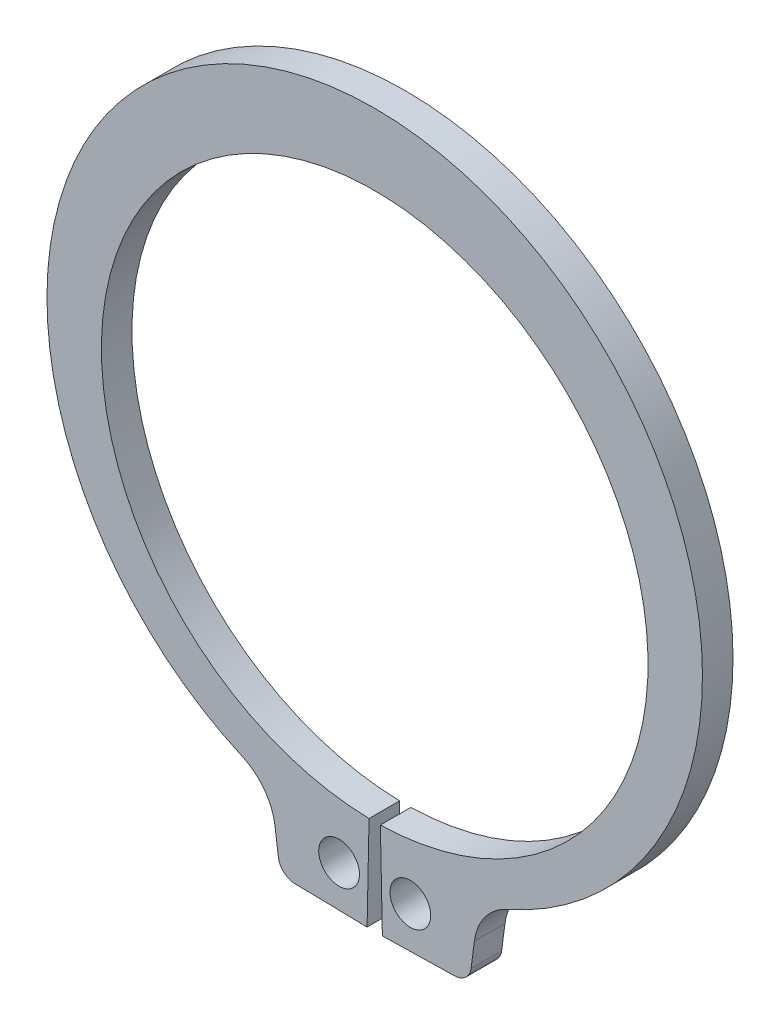
ISO-10303-21;
HEADER;
FILE_DESCRIPTION(('STEP AP214'),'2;1');
FILE_NAME('part.step','',(''),(''),'','','');
FILE_SCHEMA(('AUTOMOTIVE_DESIGN { 1 0 10303 214 1 1 1 1 }'));
ENDSEC;
DATA;
#1=APPLICATION_CONTEXT('core data for automotive mechanical design processes');
#2=APPLICATION_PROTOCOL_DEFINITION('international standard','automotive_design',2000,#1);
#3=PRODUCT_CONTEXT('',#1,'mechanical');
#4=PRODUCT('Part','Part','',(#3));
#5=PRODUCT_RELATED_PRODUCT_CATEGORY('part','',(#4));
#6=PRODUCT_DEFINITION_FORMATION('','',#4);
#7=PRODUCT_DEFINITION_CONTEXT('part definition',#1,'design');
#8=PRODUCT_DEFINITION('design','',#6,#7);
#9=PRODUCT_DEFINITION_SHAPE('','',#8);
#10=(LENGTH_UNIT() NAMED_UNIT(*) SI_UNIT(.MILLI.,.METRE.));
#11=(NAMED_UNIT(*) PLANE_ANGLE_UNIT() SI_UNIT($,.RADIAN.));
#12=(NAMED_UNIT(*) SI_UNIT($,.STERADIAN.) SOLID_ANGLE_UNIT());
#13=UNCERTAINTY_MEASURE_WITH_UNIT(LENGTH_MEASURE(1.E-05),#10,'distance_accuracy_value','');
#14=(GEOMETRIC_REPRESENTATION_CONTEXT(3) GLOBAL_UNCERTAINTY_ASSIGNED_CONTEXT((#13)) GLOBAL_UNIT_ASSIGNED_CONTEXT((#10,
#11,#12)) REPRESENTATION_CONTEXT('',''));
#15=CARTESIAN_POINT('',(0.,0.,0.));
#16=DIRECTION('',(0.,0.,1.));
#17=DIRECTION('',(1.,0.,0.));
#18=AXIS2_PLACEMENT_3D('',#15,#16,#17);
#19=CARTESIAN_POINT('',(0.,0.,-0.9));
#20=DIRECTION('',(0.,0.,1.));
#21=DIRECTION('',(1.,0.,0.));
#22=AXIS2_PLACEMENT_3D('',#19,#20,#21);
#23=CYLINDRICAL_SURFACE('',#22,8.05);
#24=CARTESIAN_POINT('',(0.,0.,0.));
#25=DIRECTION('',(0.,0.,-1.));
#26=DIRECTION('',(1.,0.,0.));
#27=AXIS2_PLACEMENT_3D('',#24,#25,#26);
#28=CIRCLE('',#27,8.05);
#29=CARTESIAN_POINT('',(-0.166935483870968,-8.04826891599832,0.));
#30=VERTEX_POINT('',#29);
#31=CARTESIAN_POINT('',(0.166935483870968,-8.04826891599832,0.));
#32=VERTEX_POINT('',#31);
#33=EDGE_CURVE('E155',#30,#32,#28,.T.);
#34=ORIENTED_EDGE('',*,*,#33,.F.);
#35=DIRECTION('',(0.,0.,1.));
#36=VECTOR('',#35,1.);
#37=CARTESIAN_POINT('',(-0.166935483870968,-8.04826891599832,-0.9));
#38=LINE('',#37,#36);
#39=CARTESIAN_POINT('',(-0.166935483870968,-8.04826891599832,-0.9));
#40=VERTEX_POINT('',#39);
#41=EDGE_CURVE('E11',#40,#30,#38,.T.);
#42=ORIENTED_EDGE('',*,*,#41,.F.);
#43=CARTESIAN_POINT('',(0.,0.,-0.9));
#44=DIRECTION('',(0.,0.,-1.));
#45=DIRECTION('',(1.,0.,0.));
#46=AXIS2_PLACEMENT_3D('',#43,#44,#45);
#47=CIRCLE('',#46,8.05);
#48=CARTESIAN_POINT('',(0.166935483870968,-8.04826891599832,-0.9));
#49=VERTEX_POINT('',#48);
#50=EDGE_CURVE('E188',#40,#49,#47,.T.);
#51=ORIENTED_EDGE('',*,*,#50,.T.);
#52=DIRECTION('',(0.,0.,1.));
#53=VECTOR('',#52,1.);
#54=CARTESIAN_POINT('',(0.166935483870968,-8.04826891599832,-0.9));
#55=LINE('',#54,#53);
#56=EDGE_CURVE('E37',#49,#32,#55,.T.);
#57=ORIENTED_EDGE('',*,*,#56,.T.);
#58=EDGE_LOOP('',(#34,#42,#51,#57));
#59=FACE_BOUND('',#58,.T.);
#60=ADVANCED_FACE('F34',(#59),#23,.F.);
#61=CARTESIAN_POINT('',(-0.166935483870968,-8.04826891599832,-0.9));
#62=DIRECTION('',(0.999784958509108,-0.0207373271889401,0.));
#63=DIRECTION('',(0.0207373271889401,0.999784958509108,0.));
#64=AXIS2_PLACEMENT_3D('',#61,#62,#63);
#65=PLANE('',#64);
#66=DIRECTION('',(0.0207373271889401,0.999784958509108,0.));
#67=VECTOR('',#66,1.);
#68=CARTESIAN_POINT('',(-0.166935483870968,-8.04826891599832,0.));
#69=LINE('',#68,#67);
#70=CARTESIAN_POINT('',(-0.225,-10.8476667998238,0.));
#71=VERTEX_POINT('',#70);
#72=EDGE_CURVE('E186',#71,#30,#69,.T.);
#73=ORIENTED_EDGE('',*,*,#72,.F.);
#74=DIRECTION('',(0.,0.,1.));
#75=VECTOR('',#74,1.);
#76=CARTESIAN_POINT('',(-0.225,-10.8476667998238,-0.9));
#77=LINE('',#76,#75);
#78=CARTESIAN_POINT('',(-0.225,-10.8476667998238,-0.9));
#79=VERTEX_POINT('',#78);
#80=EDGE_CURVE('E43',#79,#71,#77,.T.);
#81=ORIENTED_EDGE('',*,*,#80,.F.);
#82=DIRECTION('',(0.0207373271889401,0.999784958509108,0.));
#83=VECTOR('',#82,1.);
#84=CARTESIAN_POINT('',(-0.166935483870968,-8.04826891599832,-0.9));
#85=LINE('',#84,#83);
#86=EDGE_CURVE('E145',#79,#40,#85,.T.);
#87=ORIENTED_EDGE('',*,*,#86,.T.);
#88=ORIENTED_EDGE('',*,*,#41,.T.);
#89=EDGE_LOOP('',(#73,#81,#87,#88));
#90=FACE_BOUND('',#89,.T.);
#91=ADVANCED_FACE('F208',(#90),#65,.T.);
#92=CARTESIAN_POINT('',(-0.225,-10.8476667998238,-0.9));
#93=DIRECTION('',(-0.0207373271889397,-0.999784958509108,0.));
#94=DIRECTION('',(0.999784958509108,-0.0207373271889397,0.));
#95=AXIS2_PLACEMENT_3D('',#92,#93,#94);
#96=PLANE('',#95);
#97=DIRECTION('',(0.999784958509108,-0.0207373271889397,0.));
#98=VECTOR('',#97,1.);
#99=CARTESIAN_POINT('',(-0.225,-10.8476667998238,0.));
#100=LINE('',#99,#98);
#101=CARTESIAN_POINT('',(-2.35303297087236,-10.803527592077,0.));
#102=VERTEX_POINT('',#101);
#103=EDGE_CURVE('E132',#102,#71,#100,.T.);
#104=ORIENTED_EDGE('',*,*,#103,.F.);
#105=DIRECTION('',(0.,0.,1.));
#106=VECTOR('',#105,1.);
#107=CARTESIAN_POINT('',(-2.35303297087236,-10.803527592077,-0.9));
#108=LINE('',#107,#106);
#109=CARTESIAN_POINT('',(-2.35303297087236,-10.803527592077,-0.9));
#110=VERTEX_POINT('',#109);
#111=EDGE_CURVE('E127',#110,#102,#108,.T.);
#112=ORIENTED_EDGE('',*,*,#111,.F.);
#113=DIRECTION('',(0.999784958509108,-0.0207373271889397,0.));
#114=VECTOR('',#113,1.);
#115=CARTESIAN_POINT('',(-0.225,-10.8476667998238,-0.9));
#116=LINE('',#115,#114);
#117=EDGE_CURVE('E130',#110,#79,#116,.T.);
#118=ORIENTED_EDGE('',*,*,#117,.T.);
#119=ORIENTED_EDGE('',*,*,#80,.T.);
#120=EDGE_LOOP('',(#104,#112,#118,#119));
#121=FACE_BOUND('',#120,.T.);
#122=ADVANCED_FACE('F129',(#121),#96,.T.);
#123=CARTESIAN_POINT('',(-2.34266430727789,-10.3036351128224,-0.9));
#124=DIRECTION('',(0.,0.,1.));
#125=DIRECTION('',(1.,0.,0.));
#126=AXIS2_PLACEMENT_3D('',#123,#124,#125);
#127=CYLINDRICAL_SURFACE('',#126,0.500000000000001);
#128=CARTESIAN_POINT('',(-2.34266430727789,-10.3036351128224,0.));
#129=DIRECTION('',(0.,0.,1.));
#130=DIRECTION('',(1.,0.,0.));
#131=AXIS2_PLACEMENT_3D('',#128,#129,#130);
#132=CIRCLE('',#131,0.500000000000001);
#133=CARTESIAN_POINT('',(-2.8383867379648,-10.3688982089324,0.));
#134=VERTEX_POINT('',#133);
#135=EDGE_CURVE('E183',#134,#102,#132,.T.);
#136=ORIENTED_EDGE('',*,*,#135,.F.);
#137=DIRECTION('',(0.,0.,1.));
#138=VECTOR('',#137,1.);
#139=CARTESIAN_POINT('',(-2.8383867379648,-10.3688982089324,-0.9));
#140=LINE('',#139,#138);
#141=CARTESIAN_POINT('',(-2.8383867379648,-10.3688982089324,-0.9));
#142=VERTEX_POINT('',#141);
#143=EDGE_CURVE('E137',#142,#134,#140,.T.);
#144=ORIENTED_EDGE('',*,*,#143,.F.);
#145=CARTESIAN_POINT('',(-2.34266430727789,-10.3036351128224,-0.9));
#146=DIRECTION('',(0.,0.,1.));
#147=DIRECTION('',(1.,0.,0.));
#148=AXIS2_PLACEMENT_3D('',#145,#146,#147);
#149=CIRCLE('',#148,0.500000000000001);
#150=EDGE_CURVE('E143',#142,#110,#149,.T.);
#151=ORIENTED_EDGE('',*,*,#150,.T.);
#152=ORIENTED_EDGE('',*,*,#111,.T.);
#153=EDGE_LOOP('',(#136,#144,#151,#152));
#154=FACE_BOUND('',#153,.T.);
#155=ADVANCED_FACE('F147',(#154),#127,.T.);
#156=CARTESIAN_POINT('',(-2.93640518614246,-9.62437417806401,-0.9));
#157=DIRECTION('',(-0.99144486137381,-0.130526192220053,0.));
#158=DIRECTION('',(0.130526192220053,-0.99144486137381,0.));
#159=AXIS2_PLACEMENT_3D('',#156,#157,#158);
#160=PLANE('',#159);
#161=DIRECTION('',(0.130526192220053,-0.99144486137381,0.));
#162=VECTOR('',#161,1.);
#163=CARTESIAN_POINT('',(-2.93640518614246,-9.62437417806401,0.));
#164=LINE('',#163,#162);
#165=CARTESIAN_POINT('',(-2.93640518614246,-9.62437417806401,0.));
#166=VERTEX_POINT('',#165);
#167=EDGE_CURVE('E180',#166,#134,#164,.T.);
#168=ORIENTED_EDGE('',*,*,#167,.F.);
#169=DIRECTION('',(0.,0.,1.));
#170=VECTOR('',#169,1.);
#171=CARTESIAN_POINT('',(-2.93640518614246,-9.62437417806401,-0.9));
#172=LINE('',#171,#170);
#173=CARTESIAN_POINT('',(-2.93640518614246,-9.62437417806401,-0.9));
#174=VERTEX_POINT('',#173);
#175=EDGE_CURVE('E192',#174,#166,#172,.T.);
#176=ORIENTED_EDGE('',*,*,#175,.F.);
#177=DIRECTION('',(0.130526192220053,-0.99144486137381,0.));
#178=VECTOR('',#177,1.);
#179=CARTESIAN_POINT('',(-2.93640518614246,-9.62437417806401,-0.9));
#180=LINE('',#179,#178);
#181=EDGE_CURVE('E148',#174,#142,#180,.T.);
#182=ORIENTED_EDGE('',*,*,#181,.T.);
#183=ORIENTED_EDGE('',*,*,#143,.T.);
#184=EDGE_LOOP('',(#168,#176,#182,#183));
#185=FACE_BOUND('',#184,.T.);
#186=ADVANCED_FACE('F221',(#185),#160,.T.);
#187=CARTESIAN_POINT('',(-4.57196036474557,-9.83969910226911,-0.9));
#188=DIRECTION('',(0.,0.,1.));
#189=DIRECTION('',(1.,0.,0.));
#190=AXIS2_PLACEMENT_3D('',#187,#188,#189);
#191=CYLINDRICAL_SURFACE('',#190,1.64966831976594);
#192=CARTESIAN_POINT('',(-4.57196036474557,-9.83969910226911,0.));
#193=DIRECTION('',(0.,0.,-1.));
#194=DIRECTION('',(1.,0.,0.));
#195=AXIS2_PLACEMENT_3D('',#192,#193,#194);
#196=CIRCLE('',#195,1.64966831976594);
#197=CARTESIAN_POINT('',(-3.90466480786741,-8.3310168278952,0.));
#198=VERTEX_POINT('',#197);
#199=EDGE_CURVE('E177',#198,#166,#196,.T.);
#200=ORIENTED_EDGE('',*,*,#199,.F.);
#201=DIRECTION('',(0.,0.,1.));
#202=VECTOR('',#201,1.);
#203=CARTESIAN_POINT('',(-3.90466480786741,-8.3310168278952,-0.9));
#204=LINE('',#203,#202);
#205=CARTESIAN_POINT('',(-3.90466480786741,-8.3310168278952,-0.9));
#206=VERTEX_POINT('',#205);
#207=EDGE_CURVE('E194',#206,#198,#204,.T.);
#208=ORIENTED_EDGE('',*,*,#207,.F.);
#209=CARTESIAN_POINT('',(-4.57196036474557,-9.83969910226911,-0.9));
#210=DIRECTION('',(0.,0.,-1.));
#211=DIRECTION('',(1.,0.,0.));
#212=AXIS2_PLACEMENT_3D('',#209,#210,#211);
#213=CIRCLE('',#212,1.64966831976594);
#214=EDGE_CURVE('E150',#206,#174,#213,.T.);
#215=ORIENTED_EDGE('',*,*,#214,.T.);
#216=ORIENTED_EDGE('',*,*,#175,.T.);
#217=EDGE_LOOP('',(#200,#208,#215,#216));
#218=FACE_BOUND('',#217,.T.);
#219=ADVANCED_FACE('F224',(#218),#191,.F.);
#220=CARTESIAN_POINT('',(0.,0.497003263473061,-0.9));
#221=DIRECTION('',(0.,0.,1.));
#222=DIRECTION('',(1.,0.,0.));
#223=AXIS2_PLACEMENT_3D('',#220,#221,#222);
#224=CYLINDRICAL_SURFACE('',#223,9.65299673652694);
#225=CARTESIAN_POINT('',(0.,0.497003263473061,0.));
#226=DIRECTION('',(0.,0.,1.));
#227=DIRECTION('',(1.,0.,0.));
#228=AXIS2_PLACEMENT_3D('',#225,#226,#227);
#229=CIRCLE('',#228,9.65299673652694);
#230=CARTESIAN_POINT('',(3.90466480786741,-8.3310168278952,0.));
#231=VERTEX_POINT('',#230);
#232=EDGE_CURVE('E174',#231,#198,#229,.T.);
#233=ORIENTED_EDGE('',*,*,#232,.F.);
#234=DIRECTION('',(0.,0.,1.));
#235=VECTOR('',#234,1.);
#236=CARTESIAN_POINT('',(3.90466480786741,-8.3310168278952,-0.9));
#237=LINE('',#236,#235);
#238=CARTESIAN_POINT('',(3.90466480786741,-8.3310168278952,-0.9));
#239=VERTEX_POINT('',#238);
#240=EDGE_CURVE('E196',#239,#231,#237,.T.);
#241=ORIENTED_EDGE('',*,*,#240,.F.);
#242=CARTESIAN_POINT('',(0.,0.497003263473061,-0.9));
#243=DIRECTION('',(0.,0.,1.));
#244=DIRECTION('',(1.,0.,0.));
#245=AXIS2_PLACEMENT_3D('',#242,#243,#244);
#246=CIRCLE('',#245,9.65299673652694);
#247=EDGE_CURVE('E298',#239,#206,#246,.T.);
#248=ORIENTED_EDGE('',*,*,#247,.T.);
#249=ORIENTED_EDGE('',*,*,#207,.T.);
#250=EDGE_LOOP('',(#233,#241,#248,#249));
#251=FACE_BOUND('',#250,.T.);
#252=ADVANCED_FACE('F228',(#251),#224,.T.);
#253=CARTESIAN_POINT('',(4.57196036474557,-9.83969910226911,-0.9));
#254=DIRECTION('',(0.,0.,1.));
#255=DIRECTION('',(1.,0.,0.));
#256=AXIS2_PLACEMENT_3D('',#253,#254,#255);
#257=CYLINDRICAL_SURFACE('',#256,1.64966831976594);
#258=CARTESIAN_POINT('',(4.57196036474557,-9.83969910226911,0.));
#259=DIRECTION('',(0.,0.,-1.));
#260=DIRECTION('',(1.,0.,0.));
#261=AXIS2_PLACEMENT_3D('',#258,#259,#260);
#262=CIRCLE('',#261,1.64966831976594);
#263=CARTESIAN_POINT('',(2.93640518614246,-9.62437417806401,0.));
#264=VERTEX_POINT('',#263);
#265=EDGE_CURVE('E171',#264,#231,#262,.T.);
#266=ORIENTED_EDGE('',*,*,#265,.F.);
#267=DIRECTION('',(0.,0.,1.));
#268=VECTOR('',#267,1.);
#269=CARTESIAN_POINT('',(2.93640518614246,-9.62437417806401,-0.9));
#270=LINE('',#269,#268);
#271=CARTESIAN_POINT('',(2.93640518614246,-9.62437417806401,-0.9));
#272=VERTEX_POINT('',#271);
#273=EDGE_CURVE('E198',#272,#264,#270,.T.);
#274=ORIENTED_EDGE('',*,*,#273,.F.);
#275=CARTESIAN_POINT('',(4.57196036474557,-9.83969910226911,-0.9));
#276=DIRECTION('',(0.,0.,-1.));
#277=DIRECTION('',(1.,0.,0.));
#278=AXIS2_PLACEMENT_3D('',#275,#276,#277);
#279=CIRCLE('',#278,1.64966831976594);
#280=EDGE_CURVE('E295',#272,#239,#279,.T.);
#281=ORIENTED_EDGE('',*,*,#280,.T.);
#282=ORIENTED_EDGE('',*,*,#240,.T.);
#283=EDGE_LOOP('',(#266,#274,#281,#282));
#284=FACE_BOUND('',#283,.T.);
#285=ADVANCED_FACE('F232',(#284),#257,.F.);
#286=CARTESIAN_POINT('',(2.93640518614246,-9.62437417806401,-0.9));
#287=DIRECTION('',(0.99144486137381,-0.130526192220053,0.));
#288=DIRECTION('',(0.130526192220053,0.99144486137381,0.));
#289=AXIS2_PLACEMENT_3D('',#286,#287,#288);
#290=PLANE('',#289);
#291=DIRECTION('',(0.130526192220053,0.99144486137381,0.));
#292=VECTOR('',#291,1.);
#293=CARTESIAN_POINT('',(2.93640518614246,-9.62437417806401,0.));
#294=LINE('',#293,#292);
#295=CARTESIAN_POINT('',(2.83838673796479,-10.3688982089324,0.));
#296=VERTEX_POINT('',#295);
#297=EDGE_CURVE('E168',#296,#264,#294,.T.);
#298=ORIENTED_EDGE('',*,*,#297,.F.);
#299=DIRECTION('',(0.,0.,1.));
#300=VECTOR('',#299,1.);
#301=CARTESIAN_POINT('',(2.83838673796479,-10.3688982089324,-0.9));
#302=LINE('',#301,#300);
#303=CARTESIAN_POINT('',(2.83838673796479,-10.3688982089324,-0.9));
#304=VERTEX_POINT('',#303);
#305=EDGE_CURVE('E200',#304,#296,#302,.T.);
#306=ORIENTED_EDGE('',*,*,#305,.F.);
#307=DIRECTION('',(0.130526192220053,0.99144486137381,0.));
#308=VECTOR('',#307,1.);
#309=CARTESIAN_POINT('',(2.93640518614246,-9.62437417806401,-0.9));
#310=LINE('',#309,#308);
#311=EDGE_CURVE('E292',#304,#272,#310,.T.);
#312=ORIENTED_EDGE('',*,*,#311,.T.);
#313=ORIENTED_EDGE('',*,*,#273,.T.);
#314=EDGE_LOOP('',(#298,#306,#312,#313));
#315=FACE_BOUND('',#314,.T.);
#316=ADVANCED_FACE('F236',(#315),#290,.T.);
#317=CARTESIAN_POINT('',(2.34266430727789,-10.3036351128224,-0.9));
#318=DIRECTION('',(0.,0.,1.));
#319=DIRECTION('',(1.,0.,0.));
#320=AXIS2_PLACEMENT_3D('',#317,#318,#319);
#321=CYLINDRICAL_SURFACE('',#320,0.500000000000001);
#322=CARTESIAN_POINT('',(2.34266430727789,-10.3036351128224,0.));
#323=DIRECTION('',(0.,0.,1.));
#324=DIRECTION('',(-1.,0.,0.));
#325=AXIS2_PLACEMENT_3D('',#322,#323,#324);
#326=CIRCLE('',#325,0.500000000000001);
#327=CARTESIAN_POINT('',(2.35303297087236,-10.803527592077,0.));
#328=VERTEX_POINT('',#327);
#329=EDGE_CURVE('E165',#328,#296,#326,.T.);
#330=ORIENTED_EDGE('',*,*,#329,.F.);
#331=DIRECTION('',(0.,0.,1.));
#332=VECTOR('',#331,1.);
#333=CARTESIAN_POINT('',(2.35303297087236,-10.803527592077,-0.9));
#334=LINE('',#333,#332);
#335=CARTESIAN_POINT('',(2.35303297087236,-10.803527592077,-0.9));
#336=VERTEX_POINT('',#335);
#337=EDGE_CURVE('E202',#336,#328,#334,.T.);
#338=ORIENTED_EDGE('',*,*,#337,.F.);
#339=CARTESIAN_POINT('',(2.34266430727789,-10.3036351128224,-0.9));
#340=DIRECTION('',(0.,0.,1.));
#341=DIRECTION('',(-1.,0.,0.));
#342=AXIS2_PLACEMENT_3D('',#339,#340,#341);
#343=CIRCLE('',#342,0.500000000000001);
#344=EDGE_CURVE('E289',#336,#304,#343,.T.);
#345=ORIENTED_EDGE('',*,*,#344,.T.);
#346=ORIENTED_EDGE('',*,*,#305,.T.);
#347=EDGE_LOOP('',(#330,#338,#345,#346));
#348=FACE_BOUND('',#347,.T.);
#349=ADVANCED_FACE('F240',(#348),#321,.T.);
#350=CARTESIAN_POINT('',(0.225,-10.8476667998238,-0.9));
#351=DIRECTION('',(0.0207373271889397,-0.999784958509108,0.));
#352=DIRECTION('',(0.999784958509108,0.0207373271889397,0.));
#353=AXIS2_PLACEMENT_3D('',#350,#351,#352);
#354=PLANE('',#353);
#355=DIRECTION('',(0.999784958509108,0.0207373271889397,0.));
#356=VECTOR('',#355,1.);
#357=CARTESIAN_POINT('',(0.225,-10.8476667998238,0.));
#358=LINE('',#357,#356);
#359=CARTESIAN_POINT('',(0.225,-10.8476667998238,0.));
#360=VERTEX_POINT('',#359);
#361=EDGE_CURVE('E162',#360,#328,#358,.T.);
#362=ORIENTED_EDGE('',*,*,#361,.F.);
#363=DIRECTION('',(0.,0.,1.));
#364=VECTOR('',#363,1.);
#365=CARTESIAN_POINT('',(0.225,-10.8476667998238,-0.9));
#366=LINE('',#365,#364);
#367=CARTESIAN_POINT('',(0.225,-10.8476667998238,-0.9));
#368=VERTEX_POINT('',#367);
#369=EDGE_CURVE('E203',#368,#360,#366,.T.);
#370=ORIENTED_EDGE('',*,*,#369,.F.);
#371=DIRECTION('',(0.999784958509108,0.0207373271889397,0.));
#372=VECTOR('',#371,1.);
#373=CARTESIAN_POINT('',(0.225,-10.8476667998238,-0.9));
#374=LINE('',#373,#372);
#375=EDGE_CURVE('E286',#368,#336,#374,.T.);
#376=ORIENTED_EDGE('',*,*,#375,.T.);
#377=ORIENTED_EDGE('',*,*,#337,.T.);
#378=EDGE_LOOP('',(#362,#370,#376,#377));
#379=FACE_BOUND('',#378,.T.);
#380=ADVANCED_FACE('F244',(#379),#354,.T.);
#381=CARTESIAN_POINT('',(0.166935483870968,-8.04826891599832,-0.9));
#382=DIRECTION('',(-0.999784958509108,-0.0207373271889401,0.));
#383=DIRECTION('',(0.0207373271889401,-0.999784958509108,0.));
#384=AXIS2_PLACEMENT_3D('',#381,#382,#383);
#385=PLANE('',#384);
#386=DIRECTION('',(0.0207373271889401,-0.999784958509108,0.));
#387=VECTOR('',#386,1.);
#388=CARTESIAN_POINT('',(0.166935483870968,-8.04826891599832,0.));
#389=LINE('',#388,#387);
#390=EDGE_CURVE('E158',#32,#360,#389,.T.);
#391=ORIENTED_EDGE('',*,*,#390,.F.);
#392=ORIENTED_EDGE('',*,*,#56,.F.);
#393=DIRECTION('',(0.0207373271889401,-0.999784958509108,0.));
#394=VECTOR('',#393,1.);
#395=CARTESIAN_POINT('',(0.166935483870968,-8.04826891599832,-0.9));
#396=LINE('',#395,#394);
#397=EDGE_CURVE('E284',#49,#368,#396,.T.);
#398=ORIENTED_EDGE('',*,*,#397,.T.);
#399=ORIENTED_EDGE('',*,*,#369,.T.);
#400=EDGE_LOOP('',(#391,#392,#398,#399));
#401=FACE_BOUND('',#400,.T.);
#402=ADVANCED_FACE('F205',(#401),#385,.T.);
#403=CARTESIAN_POINT('',(0.,0.,-0.9));
#404=DIRECTION('',(0.,0.,1.));
#405=DIRECTION('',(1.,0.,0.));
#406=AXIS2_PLACEMENT_3D('',#403,#404,#405);
#407=PLANE('',#406);
#408=CARTESIAN_POINT('',(-1.05,-9.61785449047759,-0.9));
#409=DIRECTION('',(0.,0.,1.));
#410=DIRECTION('',(1.,0.,0.));
#411=AXIS2_PLACEMENT_3D('',#408,#409,#410);
#412=CIRCLE('',#411,0.6);
#413=CARTESIAN_POINT('',(-0.45,-9.61785449047759,-0.9));
#414=VERTEX_POINT('',#413);
#415=EDGE_CURVE('E271',#414,#414,#412,.T.);
#416=ORIENTED_EDGE('',*,*,#415,.T.);
#417=EDGE_LOOP('',(#416));
#418=FACE_BOUND('',#417,.T.);
#419=CARTESIAN_POINT('',(1.05,-9.61785449047759,-0.9));
#420=DIRECTION('',(0.,0.,1.));
#421=DIRECTION('',(1.,0.,0.));
#422=AXIS2_PLACEMENT_3D('',#419,#420,#421);
#423=CIRCLE('',#422,0.6);
#424=CARTESIAN_POINT('',(1.65,-9.61785449047759,-0.9));
#425=VERTEX_POINT('',#424);
#426=EDGE_CURVE('E159',#425,#425,#423,.T.);
#427=ORIENTED_EDGE('',*,*,#426,.T.);
#428=EDGE_LOOP('',(#427));
#429=FACE_BOUND('',#428,.T.);
#430=ORIENTED_EDGE('',*,*,#50,.F.);
#431=ORIENTED_EDGE('',*,*,#86,.F.);
#432=ORIENTED_EDGE('',*,*,#117,.F.);
#433=ORIENTED_EDGE('',*,*,#150,.F.);
#434=ORIENTED_EDGE('',*,*,#181,.F.);
#435=ORIENTED_EDGE('',*,*,#214,.F.);
#436=ORIENTED_EDGE('',*,*,#247,.F.);
#437=ORIENTED_EDGE('',*,*,#280,.F.);
#438=ORIENTED_EDGE('',*,*,#311,.F.);
#439=ORIENTED_EDGE('',*,*,#344,.F.);
#440=ORIENTED_EDGE('',*,*,#375,.F.);
#441=ORIENTED_EDGE('',*,*,#397,.F.);
#442=EDGE_LOOP('',(#430,#431,#432,#433,#434,#435,#436,#437,#438,#439,#440,#441));
#443=FACE_BOUND('',#442,.T.);
#444=ADVANCED_FACE('F141',(#418,#429,#443),#407,.F.);
#445=CARTESIAN_POINT('',(0.,0.,0.));
#446=DIRECTION('',(0.,0.,1.));
#447=DIRECTION('',(1.,0.,0.));
#448=AXIS2_PLACEMENT_3D('',#445,#446,#447);
#449=PLANE('',#448);
#450=CARTESIAN_POINT('',(-1.05,-9.61785449047759,0.));
#451=DIRECTION('',(0.,0.,1.));
#452=DIRECTION('',(1.,0.,0.));
#453=AXIS2_PLACEMENT_3D('',#450,#451,#452);
#454=CIRCLE('',#453,0.6);
#455=CARTESIAN_POINT('',(-0.45,-9.61785449047759,0.));
#456=VERTEX_POINT('',#455);
#457=EDGE_CURVE('E274',#456,#456,#454,.T.);
#458=ORIENTED_EDGE('',*,*,#457,.F.);
#459=EDGE_LOOP('',(#458));
#460=FACE_BOUND('',#459,.T.);
#461=CARTESIAN_POINT('',(1.05,-9.61785449047759,0.));
#462=DIRECTION('',(0.,0.,1.));
#463=DIRECTION('',(1.,0.,0.));
#464=AXIS2_PLACEMENT_3D('',#461,#462,#463);
#465=CIRCLE('',#464,0.6);
#466=CARTESIAN_POINT('',(1.65,-9.61785449047759,0.));
#467=VERTEX_POINT('',#466);
#468=EDGE_CURVE('E276',#467,#467,#465,.T.);
#469=ORIENTED_EDGE('',*,*,#468,.F.);
#470=EDGE_LOOP('',(#469));
#471=FACE_BOUND('',#470,.T.);
#472=ORIENTED_EDGE('',*,*,#33,.T.);
#473=ORIENTED_EDGE('',*,*,#390,.T.);
#474=ORIENTED_EDGE('',*,*,#361,.T.);
#475=ORIENTED_EDGE('',*,*,#329,.T.);
#476=ORIENTED_EDGE('',*,*,#297,.T.);
#477=ORIENTED_EDGE('',*,*,#265,.T.);
#478=ORIENTED_EDGE('',*,*,#232,.T.);
#479=ORIENTED_EDGE('',*,*,#199,.T.);
#480=ORIENTED_EDGE('',*,*,#167,.T.);
#481=ORIENTED_EDGE('',*,*,#135,.T.);
#482=ORIENTED_EDGE('',*,*,#103,.T.);
#483=ORIENTED_EDGE('',*,*,#72,.T.);
#484=EDGE_LOOP('',(#472,#473,#474,#475,#476,#477,#478,#479,#480,#481,#482,#483));
#485=FACE_BOUND('',#484,.T.);
#486=ADVANCED_FACE('F207',(#460,#471,#485),#449,.T.);
#487=CARTESIAN_POINT('',(1.05,-9.61785449047759,-0.9));
#488=DIRECTION('',(0.,0.,1.));
#489=DIRECTION('',(1.,0.,0.));
#490=AXIS2_PLACEMENT_3D('',#487,#488,#489);
#491=CYLINDRICAL_SURFACE('',#490,0.6);
#492=ORIENTED_EDGE('',*,*,#426,.F.);
#493=EDGE_LOOP('',(#492));
#494=FACE_BOUND('',#493,.T.);
#495=ORIENTED_EDGE('',*,*,#468,.T.);
#496=EDGE_LOOP('',(#495));
#497=FACE_BOUND('',#496,.T.);
#498=ADVANCED_FACE('F256',(#494,#497),#491,.F.);
#499=CARTESIAN_POINT('',(-1.05,-9.61785449047759,-0.9));
#500=DIRECTION('',(0.,0.,1.));
#501=DIRECTION('',(1.,0.,0.));
#502=AXIS2_PLACEMENT_3D('',#499,#500,#501);
#503=CYLINDRICAL_SURFACE('',#502,0.6);
#504=ORIENTED_EDGE('',*,*,#415,.F.);
#505=EDGE_LOOP('',(#504));
#506=FACE_BOUND('',#505,.T.);
#507=ORIENTED_EDGE('',*,*,#457,.T.);
#508=EDGE_LOOP('',(#507));
#509=FACE_BOUND('',#508,.T.);
#510=ADVANCED_FACE('F263',(#506,#509),#503,.F.);
#511=CLOSED_SHELL('',(#60,#91,#122,#155,#186,#219,#252,#285,#316,#349,#380,#402,#444,#486,#498,#510));
#512=MANIFOLD_SOLID_BREP('B2',#511);
#513=ADVANCED_BREP_SHAPE_REPRESENTATION('',(#18,#512),#14);
#514=SHAPE_DEFINITION_REPRESENTATION(#9,#513);
ENDSEC;
END-ISO-10303-21;
